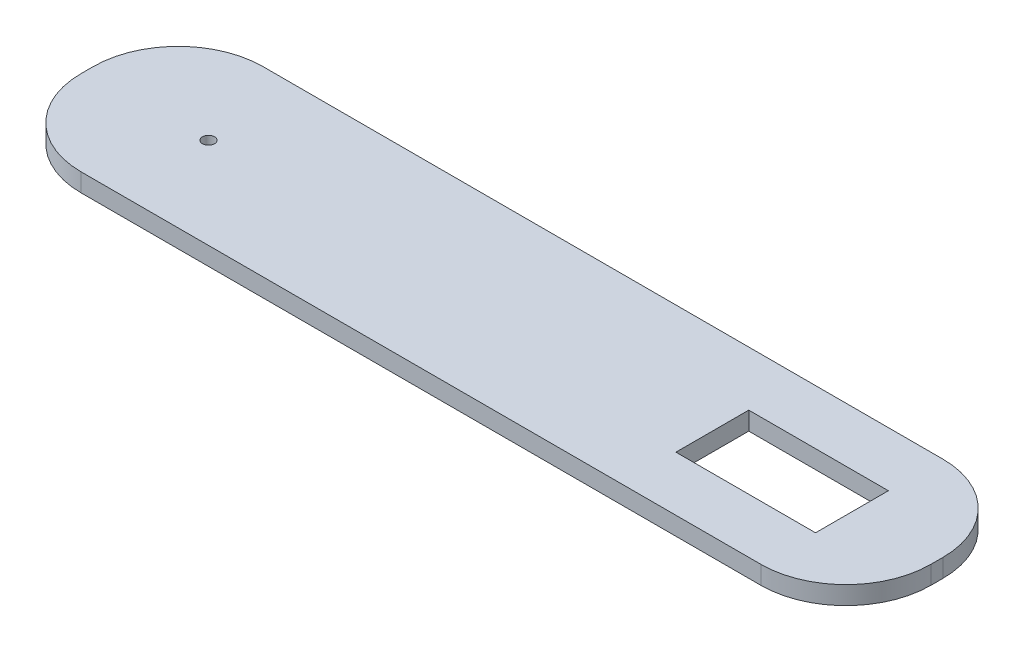
ISO-10303-21;
HEADER;
FILE_DESCRIPTION(('STEP AP214'),'2;1');
FILE_NAME('part.step','',(''),(''),'','','');
FILE_SCHEMA(('AUTOMOTIVE_DESIGN { 1 0 10303 214 1 1 1 1 }'));
ENDSEC;
DATA;
#1=APPLICATION_CONTEXT('core data for automotive mechanical design processes');
#2=APPLICATION_PROTOCOL_DEFINITION('international standard','automotive_design',2000,#1);
#3=PRODUCT_CONTEXT('',#1,'mechanical');
#4=PRODUCT('Part','Part','',(#3));
#5=PRODUCT_RELATED_PRODUCT_CATEGORY('part','',(#4));
#6=PRODUCT_DEFINITION_FORMATION('','',#4);
#7=PRODUCT_DEFINITION_CONTEXT('part definition',#1,'design');
#8=PRODUCT_DEFINITION('design','',#6,#7);
#9=PRODUCT_DEFINITION_SHAPE('','',#8);
#10=(LENGTH_UNIT() NAMED_UNIT(*) SI_UNIT(.MILLI.,.METRE.));
#11=(NAMED_UNIT(*) PLANE_ANGLE_UNIT() SI_UNIT($,.RADIAN.));
#12=(NAMED_UNIT(*) SI_UNIT($,.STERADIAN.) SOLID_ANGLE_UNIT());
#13=UNCERTAINTY_MEASURE_WITH_UNIT(LENGTH_MEASURE(1.E-05),#10,'distance_accuracy_value','');
#14=(GEOMETRIC_REPRESENTATION_CONTEXT(3) GLOBAL_UNCERTAINTY_ASSIGNED_CONTEXT((#13)) GLOBAL_UNIT_ASSIGNED_CONTEXT((#10,
#11,#12)) REPRESENTATION_CONTEXT('',''));
#15=CARTESIAN_POINT('',(0.,0.,0.));
#16=DIRECTION('',(0.,0.,1.));
#17=DIRECTION('',(1.,0.,0.));
#18=AXIS2_PLACEMENT_3D('',#15,#16,#17);
#19=CARTESIAN_POINT('',(0.,3.,0.));
#20=DIRECTION('',(1.,0.,0.));
#21=DIRECTION('',(0.,0.,-1.));
#22=AXIS2_PLACEMENT_3D('',#19,#20,#21);
#23=PLANE('',#22);
#24=DIRECTION('',(0.,0.,1.));
#25=VECTOR('',#24,1.);
#26=CARTESIAN_POINT('',(0.,3.,0.));
#27=LINE('',#26,#25);
#28=CARTESIAN_POINT('',(0.,3.,-16.));
#29=VERTEX_POINT('',#28);
#30=CARTESIAN_POINT('',(0.,3.,-14.));
#31=VERTEX_POINT('',#30);
#32=EDGE_CURVE('E189',#29,#31,#27,.T.);
#33=ORIENTED_EDGE('',*,*,#32,.F.);
#34=DIRECTION('',(0.,-1.,0.));
#35=VECTOR('',#34,1.);
#36=CARTESIAN_POINT('',(0.,3.,-16.));
#37=LINE('',#36,#35);
#38=CARTESIAN_POINT('',(0.,0.,-16.));
#39=VERTEX_POINT('',#38);
#40=EDGE_CURVE('E11',#29,#39,#37,.T.);
#41=ORIENTED_EDGE('',*,*,#40,.T.);
#42=DIRECTION('',(0.,0.,1.));
#43=VECTOR('',#42,1.);
#44=CARTESIAN_POINT('',(0.,0.,0.));
#45=LINE('',#44,#43);
#46=CARTESIAN_POINT('',(0.,0.,-14.));
#47=VERTEX_POINT('',#46);
#48=EDGE_CURVE('E205',#39,#47,#45,.T.);
#49=ORIENTED_EDGE('',*,*,#48,.T.);
#50=DIRECTION('',(0.,-1.,0.));
#51=VECTOR('',#50,1.);
#52=CARTESIAN_POINT('',(0.,3.,-14.));
#53=LINE('',#52,#51);
#54=EDGE_CURVE('E48',#47,#31,#53,.F.);
#55=ORIENTED_EDGE('',*,*,#54,.T.);
#56=EDGE_LOOP('',(#33,#41,#49,#55));
#57=FACE_BOUND('',#56,.T.);
#58=ADVANCED_FACE('F39',(#57),#23,.F.);
#59=CARTESIAN_POINT('',(0.,3.,0.));
#60=DIRECTION('',(0.,0.,-1.));
#61=DIRECTION('',(-1.,0.,0.));
#62=AXIS2_PLACEMENT_3D('',#59,#60,#61);
#63=PLANE('',#62);
#64=DIRECTION('',(1.,0.,0.));
#65=VECTOR('',#64,1.);
#66=CARTESIAN_POINT('',(0.,0.,0.));
#67=LINE('',#66,#65);
#68=CARTESIAN_POINT('',(14.,0.,0.));
#69=VERTEX_POINT('',#68);
#70=CARTESIAN_POINT('',(126.,0.,0.));
#71=VERTEX_POINT('',#70);
#72=EDGE_CURVE('E209',#69,#71,#67,.T.);
#73=ORIENTED_EDGE('',*,*,#72,.T.);
#74=DIRECTION('',(0.,-1.,0.));
#75=VECTOR('',#74,1.);
#76=CARTESIAN_POINT('',(126.,3.,0.));
#77=LINE('',#76,#75);
#78=CARTESIAN_POINT('',(126.,3.,0.));
#79=VERTEX_POINT('',#78);
#80=EDGE_CURVE('E55',#71,#79,#77,.F.);
#81=ORIENTED_EDGE('',*,*,#80,.T.);
#82=DIRECTION('',(1.,0.,0.));
#83=VECTOR('',#82,1.);
#84=CARTESIAN_POINT('',(0.,3.,0.));
#85=LINE('',#84,#83);
#86=CARTESIAN_POINT('',(14.,3.,0.));
#87=VERTEX_POINT('',#86);
#88=EDGE_CURVE('E192',#87,#79,#85,.T.);
#89=ORIENTED_EDGE('',*,*,#88,.F.);
#90=DIRECTION('',(0.,-1.,0.));
#91=VECTOR('',#90,1.);
#92=CARTESIAN_POINT('',(14.,3.,0.));
#93=LINE('',#92,#91);
#94=EDGE_CURVE('E256',#87,#69,#93,.T.);
#95=ORIENTED_EDGE('',*,*,#94,.T.);
#96=EDGE_LOOP('',(#73,#81,#89,#95));
#97=FACE_BOUND('',#96,.T.);
#98=ADVANCED_FACE('F272',(#97),#63,.F.);
#99=CARTESIAN_POINT('',(140.,3.,0.));
#100=DIRECTION('',(-1.,0.,0.));
#101=DIRECTION('',(0.,0.,1.));
#102=AXIS2_PLACEMENT_3D('',#99,#100,#101);
#103=PLANE('',#102);
#104=DIRECTION('',(0.,0.,-1.));
#105=VECTOR('',#104,1.);
#106=CARTESIAN_POINT('',(140.,0.,0.));
#107=LINE('',#106,#105);
#108=CARTESIAN_POINT('',(140.,0.,-14.));
#109=VERTEX_POINT('',#108);
#110=CARTESIAN_POINT('',(140.,0.,-16.));
#111=VERTEX_POINT('',#110);
#112=EDGE_CURVE('E213',#109,#111,#107,.T.);
#113=ORIENTED_EDGE('',*,*,#112,.T.);
#114=DIRECTION('',(0.,-1.,0.));
#115=VECTOR('',#114,1.);
#116=CARTESIAN_POINT('',(140.,3.,-16.));
#117=LINE('',#116,#115);
#118=CARTESIAN_POINT('',(140.,3.,-16.));
#119=VERTEX_POINT('',#118);
#120=EDGE_CURVE('E242',#111,#119,#117,.F.);
#121=ORIENTED_EDGE('',*,*,#120,.T.);
#122=DIRECTION('',(0.,0.,-1.));
#123=VECTOR('',#122,1.);
#124=CARTESIAN_POINT('',(140.,3.,0.));
#125=LINE('',#124,#123);
#126=CARTESIAN_POINT('',(140.,3.,-14.));
#127=VERTEX_POINT('',#126);
#128=EDGE_CURVE('E196',#127,#119,#125,.T.);
#129=ORIENTED_EDGE('',*,*,#128,.F.);
#130=DIRECTION('',(0.,-1.,0.));
#131=VECTOR('',#130,1.);
#132=CARTESIAN_POINT('',(140.,3.,-14.));
#133=LINE('',#132,#131);
#134=EDGE_CURVE('E238',#127,#109,#133,.T.);
#135=ORIENTED_EDGE('',*,*,#134,.T.);
#136=EDGE_LOOP('',(#113,#121,#129,#135));
#137=FACE_BOUND('',#136,.T.);
#138=ADVANCED_FACE('F281',(#137),#103,.F.);
#139=CARTESIAN_POINT('',(0.,3.,-30.));
#140=DIRECTION('',(0.,0.,1.));
#141=DIRECTION('',(1.,0.,0.));
#142=AXIS2_PLACEMENT_3D('',#139,#140,#141);
#143=PLANE('',#142);
#144=DIRECTION('',(-1.,0.,0.));
#145=VECTOR('',#144,1.);
#146=CARTESIAN_POINT('',(0.,3.,-30.));
#147=LINE('',#146,#145);
#148=CARTESIAN_POINT('',(126.,3.,-30.));
#149=VERTEX_POINT('',#148);
#150=CARTESIAN_POINT('',(14.,3.,-30.));
#151=VERTEX_POINT('',#150);
#152=EDGE_CURVE('E200',#149,#151,#147,.T.);
#153=ORIENTED_EDGE('',*,*,#152,.F.);
#154=DIRECTION('',(0.,-1.,0.));
#155=VECTOR('',#154,1.);
#156=CARTESIAN_POINT('',(126.,3.,-30.));
#157=LINE('',#156,#155);
#158=CARTESIAN_POINT('',(126.,0.,-30.));
#159=VERTEX_POINT('',#158);
#160=EDGE_CURVE('E222',#149,#159,#157,.T.);
#161=ORIENTED_EDGE('',*,*,#160,.T.);
#162=DIRECTION('',(-1.,0.,0.));
#163=VECTOR('',#162,1.);
#164=CARTESIAN_POINT('',(0.,0.,-30.));
#165=LINE('',#164,#163);
#166=CARTESIAN_POINT('',(14.,0.,-30.));
#167=VERTEX_POINT('',#166);
#168=EDGE_CURVE('E193',#159,#167,#165,.T.);
#169=ORIENTED_EDGE('',*,*,#168,.T.);
#170=DIRECTION('',(0.,-1.,0.));
#171=VECTOR('',#170,1.);
#172=CARTESIAN_POINT('',(14.,3.,-30.));
#173=LINE('',#172,#171);
#174=EDGE_CURVE('E204',#167,#151,#173,.F.);
#175=ORIENTED_EDGE('',*,*,#174,.T.);
#176=EDGE_LOOP('',(#153,#161,#169,#175));
#177=FACE_BOUND('',#176,.T.);
#178=ADVANCED_FACE('F289',(#177),#143,.F.);
#179=CARTESIAN_POINT('',(0.,3.,0.));
#180=DIRECTION('',(0.,-1.,0.));
#181=DIRECTION('',(0.,0.,-1.));
#182=AXIS2_PLACEMENT_3D('',#179,#180,#181);
#183=PLANE('',#182);
#184=CARTESIAN_POINT('',(20.,3.,-15.));
#185=DIRECTION('',(0.,1.,0.));
#186=DIRECTION('',(0.,0.,1.));
#187=AXIS2_PLACEMENT_3D('',#184,#185,#186);
#188=CIRCLE('',#187,1.);
#189=CARTESIAN_POINT('',(20.,3.,-14.));
#190=VERTEX_POINT('',#189);
#191=EDGE_CURVE('E166',#190,#190,#188,.T.);
#192=ORIENTED_EDGE('',*,*,#191,.F.);
#193=EDGE_LOOP('',(#192));
#194=FACE_BOUND('',#193,.T.);
#195=DIRECTION('',(1.,0.,0.));
#196=VECTOR('',#195,1.);
#197=CARTESIAN_POINT('',(103.,3.,-9.));
#198=LINE('',#197,#196);
#199=CARTESIAN_POINT('',(103.,3.,-9.));
#200=VERTEX_POINT('',#199);
#201=CARTESIAN_POINT('',(126.,3.,-9.));
#202=VERTEX_POINT('',#201);
#203=EDGE_CURVE('E175',#200,#202,#198,.T.);
#204=ORIENTED_EDGE('',*,*,#203,.F.);
#205=DIRECTION('',(0.,0.,1.));
#206=VECTOR('',#205,1.);
#207=CARTESIAN_POINT('',(103.,3.,-21.));
#208=LINE('',#207,#206);
#209=CARTESIAN_POINT('',(103.,3.,-21.));
#210=VERTEX_POINT('',#209);
#211=EDGE_CURVE('E138',#210,#200,#208,.T.);
#212=ORIENTED_EDGE('',*,*,#211,.F.);
#213=DIRECTION('',(-1.,0.,0.));
#214=VECTOR('',#213,1.);
#215=CARTESIAN_POINT('',(103.,3.,-21.));
#216=LINE('',#215,#214);
#217=CARTESIAN_POINT('',(126.,3.,-21.));
#218=VERTEX_POINT('',#217);
#219=EDGE_CURVE('E159',#218,#210,#216,.T.);
#220=ORIENTED_EDGE('',*,*,#219,.F.);
#221=DIRECTION('',(0.,0.,-1.));
#222=VECTOR('',#221,1.);
#223=CARTESIAN_POINT('',(126.,3.,-21.));
#224=LINE('',#223,#222);
#225=EDGE_CURVE('E163',#202,#218,#224,.T.);
#226=ORIENTED_EDGE('',*,*,#225,.F.);
#227=EDGE_LOOP('',(#204,#212,#220,#226));
#228=FACE_BOUND('',#227,.T.);
#229=ORIENTED_EDGE('',*,*,#128,.T.);
#230=CARTESIAN_POINT('',(126.,3.,-16.));
#231=DIRECTION('',(0.,-1.,0.));
#232=DIRECTION('',(0.,0.,-1.));
#233=AXIS2_PLACEMENT_3D('',#230,#231,#232);
#234=CIRCLE('',#233,14.);
#235=EDGE_CURVE('E253',#119,#149,#234,.F.);
#236=ORIENTED_EDGE('',*,*,#235,.T.);
#237=ORIENTED_EDGE('',*,*,#152,.T.);
#238=CARTESIAN_POINT('',(14.,3.,-16.));
#239=DIRECTION('',(0.,-1.,0.));
#240=DIRECTION('',(0.,0.,-1.));
#241=AXIS2_PLACEMENT_3D('',#238,#239,#240);
#242=CIRCLE('',#241,14.);
#243=EDGE_CURVE('E247',#151,#29,#242,.F.);
#244=ORIENTED_EDGE('',*,*,#243,.T.);
#245=ORIENTED_EDGE('',*,*,#32,.T.);
#246=CARTESIAN_POINT('',(14.,3.,-14.));
#247=DIRECTION('',(0.,-1.,0.));
#248=DIRECTION('',(0.,0.,-1.));
#249=AXIS2_PLACEMENT_3D('',#246,#247,#248);
#250=CIRCLE('',#249,14.);
#251=EDGE_CURVE('E62',#31,#87,#250,.F.);
#252=ORIENTED_EDGE('',*,*,#251,.T.);
#253=ORIENTED_EDGE('',*,*,#88,.T.);
#254=CARTESIAN_POINT('',(126.,3.,-14.));
#255=DIRECTION('',(0.,-1.,0.));
#256=DIRECTION('',(0.,0.,-1.));
#257=AXIS2_PLACEMENT_3D('',#254,#255,#256);
#258=CIRCLE('',#257,14.);
#259=EDGE_CURVE('E250',#79,#127,#258,.F.);
#260=ORIENTED_EDGE('',*,*,#259,.T.);
#261=EDGE_LOOP('',(#229,#236,#237,#244,#245,#252,#253,#260));
#262=FACE_BOUND('',#261,.T.);
#263=ADVANCED_FACE('F268',(#194,#228,#262),#183,.F.);
#264=CARTESIAN_POINT('',(0.,0.,0.));
#265=DIRECTION('',(0.,-1.,0.));
#266=DIRECTION('',(0.,0.,-1.));
#267=AXIS2_PLACEMENT_3D('',#264,#265,#266);
#268=PLANE('',#267);
#269=CARTESIAN_POINT('',(20.,0.,-15.));
#270=DIRECTION('',(0.,1.,0.));
#271=DIRECTION('',(0.,0.,1.));
#272=AXIS2_PLACEMENT_3D('',#269,#270,#271);
#273=CIRCLE('',#272,1.);
#274=CARTESIAN_POINT('',(20.,0.,-14.));
#275=VERTEX_POINT('',#274);
#276=EDGE_CURVE('E210',#275,#275,#273,.T.);
#277=ORIENTED_EDGE('',*,*,#276,.T.);
#278=EDGE_LOOP('',(#277));
#279=FACE_BOUND('',#278,.T.);
#280=DIRECTION('',(0.,0.,1.));
#281=VECTOR('',#280,1.);
#282=CARTESIAN_POINT('',(103.,0.,-21.));
#283=LINE('',#282,#281);
#284=CARTESIAN_POINT('',(103.,0.,-21.));
#285=VERTEX_POINT('',#284);
#286=CARTESIAN_POINT('',(103.,0.,-9.));
#287=VERTEX_POINT('',#286);
#288=EDGE_CURVE('E135',#285,#287,#283,.T.);
#289=ORIENTED_EDGE('',*,*,#288,.T.);
#290=DIRECTION('',(1.,0.,0.));
#291=VECTOR('',#290,1.);
#292=CARTESIAN_POINT('',(103.,0.,-9.));
#293=LINE('',#292,#291);
#294=CARTESIAN_POINT('',(126.,0.,-9.));
#295=VERTEX_POINT('',#294);
#296=EDGE_CURVE('E148',#287,#295,#293,.T.);
#297=ORIENTED_EDGE('',*,*,#296,.T.);
#298=DIRECTION('',(0.,0.,-1.));
#299=VECTOR('',#298,1.);
#300=CARTESIAN_POINT('',(126.,0.,-21.));
#301=LINE('',#300,#299);
#302=CARTESIAN_POINT('',(126.,0.,-21.));
#303=VERTEX_POINT('',#302);
#304=EDGE_CURVE('E153',#295,#303,#301,.T.);
#305=ORIENTED_EDGE('',*,*,#304,.T.);
#306=DIRECTION('',(-1.,0.,0.));
#307=VECTOR('',#306,1.);
#308=CARTESIAN_POINT('',(103.,0.,-21.));
#309=LINE('',#308,#307);
#310=EDGE_CURVE('E144',#303,#285,#309,.T.);
#311=ORIENTED_EDGE('',*,*,#310,.T.);
#312=EDGE_LOOP('',(#289,#297,#305,#311));
#313=FACE_BOUND('',#312,.T.);
#314=ORIENTED_EDGE('',*,*,#168,.F.);
#315=CARTESIAN_POINT('',(126.,0.,-16.));
#316=DIRECTION('',(0.,-1.,0.));
#317=DIRECTION('',(0.,0.,-1.));
#318=AXIS2_PLACEMENT_3D('',#315,#316,#317);
#319=CIRCLE('',#318,14.);
#320=EDGE_CURVE('E235',#159,#111,#319,.T.);
#321=ORIENTED_EDGE('',*,*,#320,.T.);
#322=ORIENTED_EDGE('',*,*,#112,.F.);
#323=CARTESIAN_POINT('',(126.,0.,-14.));
#324=DIRECTION('',(0.,-1.,0.));
#325=DIRECTION('',(0.,0.,-1.));
#326=AXIS2_PLACEMENT_3D('',#323,#324,#325);
#327=CIRCLE('',#326,14.);
#328=EDGE_CURVE('E232',#109,#71,#327,.T.);
#329=ORIENTED_EDGE('',*,*,#328,.T.);
#330=ORIENTED_EDGE('',*,*,#72,.F.);
#331=CARTESIAN_POINT('',(14.,0.,-14.));
#332=DIRECTION('',(0.,-1.,0.));
#333=DIRECTION('',(0.,0.,-1.));
#334=AXIS2_PLACEMENT_3D('',#331,#332,#333);
#335=CIRCLE('',#334,14.);
#336=EDGE_CURVE('E226',#69,#47,#335,.T.);
#337=ORIENTED_EDGE('',*,*,#336,.T.);
#338=ORIENTED_EDGE('',*,*,#48,.F.);
#339=CARTESIAN_POINT('',(14.,0.,-16.));
#340=DIRECTION('',(0.,-1.,0.));
#341=DIRECTION('',(0.,0.,-1.));
#342=AXIS2_PLACEMENT_3D('',#339,#340,#341);
#343=CIRCLE('',#342,14.);
#344=EDGE_CURVE('E229',#39,#167,#343,.T.);
#345=ORIENTED_EDGE('',*,*,#344,.T.);
#346=EDGE_LOOP('',(#314,#321,#322,#329,#330,#337,#338,#345));
#347=FACE_BOUND('',#346,.T.);
#348=ADVANCED_FACE('F155',(#279,#313,#347),#268,.T.);
#349=CARTESIAN_POINT('',(103.,0.,-21.));
#350=DIRECTION('',(-1.,0.,0.));
#351=DIRECTION('',(0.,0.,1.));
#352=AXIS2_PLACEMENT_3D('',#349,#350,#351);
#353=PLANE('',#352);
#354=ORIENTED_EDGE('',*,*,#211,.T.);
#355=DIRECTION('',(0.,1.,0.));
#356=VECTOR('',#355,1.);
#357=CARTESIAN_POINT('',(103.,0.,-9.));
#358=LINE('',#357,#356);
#359=EDGE_CURVE('E131',#287,#200,#358,.T.);
#360=ORIENTED_EDGE('',*,*,#359,.F.);
#361=ORIENTED_EDGE('',*,*,#288,.F.);
#362=DIRECTION('',(0.,1.,0.));
#363=VECTOR('',#362,1.);
#364=CARTESIAN_POINT('',(103.,0.,-21.));
#365=LINE('',#364,#363);
#366=EDGE_CURVE('E181',#285,#210,#365,.T.);
#367=ORIENTED_EDGE('',*,*,#366,.T.);
#368=EDGE_LOOP('',(#354,#360,#361,#367));
#369=FACE_BOUND('',#368,.T.);
#370=ADVANCED_FACE('F133',(#369),#353,.F.);
#371=CARTESIAN_POINT('',(103.,0.,-21.));
#372=DIRECTION('',(0.,0.,-1.));
#373=DIRECTION('',(-1.,0.,0.));
#374=AXIS2_PLACEMENT_3D('',#371,#372,#373);
#375=PLANE('',#374);
#376=ORIENTED_EDGE('',*,*,#219,.T.);
#377=ORIENTED_EDGE('',*,*,#366,.F.);
#378=ORIENTED_EDGE('',*,*,#310,.F.);
#379=DIRECTION('',(0.,1.,0.));
#380=VECTOR('',#379,1.);
#381=CARTESIAN_POINT('',(126.,0.,-21.));
#382=LINE('',#381,#380);
#383=EDGE_CURVE('E184',#303,#218,#382,.T.);
#384=ORIENTED_EDGE('',*,*,#383,.T.);
#385=EDGE_LOOP('',(#376,#377,#378,#384));
#386=FACE_BOUND('',#385,.T.);
#387=ADVANCED_FACE('F322',(#386),#375,.F.);
#388=CARTESIAN_POINT('',(126.,0.,-21.));
#389=DIRECTION('',(1.,0.,0.));
#390=DIRECTION('',(0.,0.,-1.));
#391=AXIS2_PLACEMENT_3D('',#388,#389,#390);
#392=PLANE('',#391);
#393=ORIENTED_EDGE('',*,*,#225,.T.);
#394=ORIENTED_EDGE('',*,*,#383,.F.);
#395=ORIENTED_EDGE('',*,*,#304,.F.);
#396=DIRECTION('',(0.,1.,0.));
#397=VECTOR('',#396,1.);
#398=CARTESIAN_POINT('',(126.,0.,-9.));
#399=LINE('',#398,#397);
#400=EDGE_CURVE('E143',#295,#202,#399,.T.);
#401=ORIENTED_EDGE('',*,*,#400,.T.);
#402=EDGE_LOOP('',(#393,#394,#395,#401));
#403=FACE_BOUND('',#402,.T.);
#404=ADVANCED_FACE('F317',(#403),#392,.F.);
#405=CARTESIAN_POINT('',(103.,0.,-9.));
#406=DIRECTION('',(0.,0.,1.));
#407=DIRECTION('',(1.,0.,0.));
#408=AXIS2_PLACEMENT_3D('',#405,#406,#407);
#409=PLANE('',#408);
#410=ORIENTED_EDGE('',*,*,#203,.T.);
#411=ORIENTED_EDGE('',*,*,#400,.F.);
#412=ORIENTED_EDGE('',*,*,#296,.F.);
#413=ORIENTED_EDGE('',*,*,#359,.T.);
#414=EDGE_LOOP('',(#410,#411,#412,#413));
#415=FACE_BOUND('',#414,.T.);
#416=ADVANCED_FACE('F149',(#415),#409,.F.);
#417=CARTESIAN_POINT('',(20.,0.,-15.));
#418=DIRECTION('',(0.,1.,0.));
#419=DIRECTION('',(0.,0.,1.));
#420=AXIS2_PLACEMENT_3D('',#417,#418,#419);
#421=CYLINDRICAL_SURFACE('',#420,1.);
#422=ORIENTED_EDGE('',*,*,#276,.F.);
#423=EDGE_LOOP('',(#422));
#424=FACE_BOUND('',#423,.T.);
#425=ORIENTED_EDGE('',*,*,#191,.T.);
#426=EDGE_LOOP('',(#425));
#427=FACE_BOUND('',#426,.T.);
#428=ADVANCED_FACE('F308',(#424,#427),#421,.F.);
#429=CARTESIAN_POINT('',(126.,3.,-16.));
#430=DIRECTION('',(0.,-1.,0.));
#431=DIRECTION('',(0.,0.,-1.));
#432=AXIS2_PLACEMENT_3D('',#429,#430,#431);
#433=CYLINDRICAL_SURFACE('',#432,14.);
#434=ORIENTED_EDGE('',*,*,#235,.F.);
#435=ORIENTED_EDGE('',*,*,#120,.F.);
#436=ORIENTED_EDGE('',*,*,#320,.F.);
#437=ORIENTED_EDGE('',*,*,#160,.F.);
#438=EDGE_LOOP('',(#434,#435,#436,#437));
#439=FACE_BOUND('',#438,.T.);
#440=ADVANCED_FACE('F287',(#439),#433,.T.);
#441=CARTESIAN_POINT('',(126.,3.,-14.));
#442=DIRECTION('',(0.,-1.,0.));
#443=DIRECTION('',(0.,0.,-1.));
#444=AXIS2_PLACEMENT_3D('',#441,#442,#443);
#445=CYLINDRICAL_SURFACE('',#444,14.);
#446=ORIENTED_EDGE('',*,*,#259,.F.);
#447=ORIENTED_EDGE('',*,*,#80,.F.);
#448=ORIENTED_EDGE('',*,*,#328,.F.);
#449=ORIENTED_EDGE('',*,*,#134,.F.);
#450=EDGE_LOOP('',(#446,#447,#448,#449));
#451=FACE_BOUND('',#450,.T.);
#452=ADVANCED_FACE('F278',(#451),#445,.T.);
#453=CARTESIAN_POINT('',(14.,3.,-16.));
#454=DIRECTION('',(0.,-1.,0.));
#455=DIRECTION('',(0.,0.,-1.));
#456=AXIS2_PLACEMENT_3D('',#453,#454,#455);
#457=CYLINDRICAL_SURFACE('',#456,14.);
#458=ORIENTED_EDGE('',*,*,#243,.F.);
#459=ORIENTED_EDGE('',*,*,#174,.F.);
#460=ORIENTED_EDGE('',*,*,#344,.F.);
#461=ORIENTED_EDGE('',*,*,#40,.F.);
#462=EDGE_LOOP('',(#458,#459,#460,#461));
#463=FACE_BOUND('',#462,.T.);
#464=ADVANCED_FACE('F292',(#463),#457,.T.);
#465=CARTESIAN_POINT('',(14.,3.,-14.));
#466=DIRECTION('',(0.,-1.,0.));
#467=DIRECTION('',(0.,0.,-1.));
#468=AXIS2_PLACEMENT_3D('',#465,#466,#467);
#469=CYLINDRICAL_SURFACE('',#468,14.);
#470=ORIENTED_EDGE('',*,*,#251,.F.);
#471=ORIENTED_EDGE('',*,*,#54,.F.);
#472=ORIENTED_EDGE('',*,*,#336,.F.);
#473=ORIENTED_EDGE('',*,*,#94,.F.);
#474=EDGE_LOOP('',(#470,#471,#472,#473));
#475=FACE_BOUND('',#474,.T.);
#476=ADVANCED_FACE('F41',(#475),#469,.T.);
#477=CLOSED_SHELL('',(#58,#98,#138,#178,#263,#348,#370,#387,#404,#416,#428,#440,#452,#464,#476));
#478=MANIFOLD_SOLID_BREP('B2',#477);
#479=ADVANCED_BREP_SHAPE_REPRESENTATION('',(#18,#478),#14);
#480=SHAPE_DEFINITION_REPRESENTATION(#9,#479);
ENDSEC;
END-ISO-10303-21;
